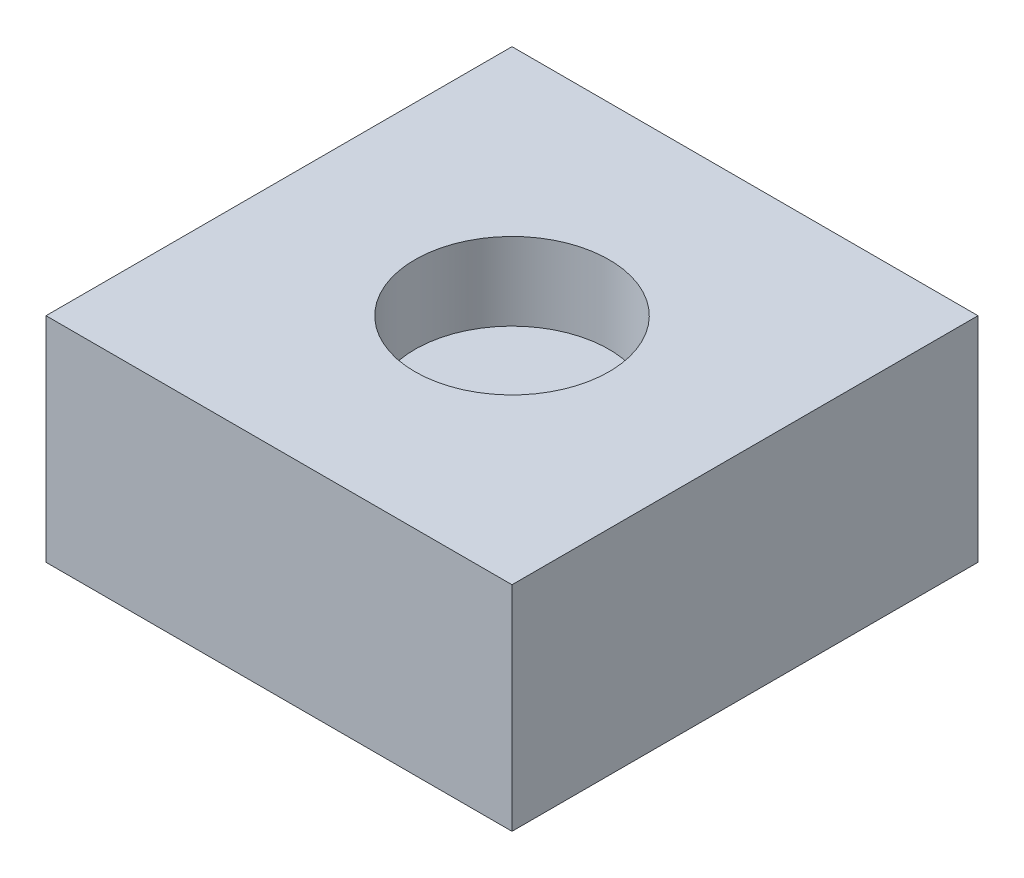
ISO-10303-21;
HEADER;
FILE_DESCRIPTION(('STEP AP214'),'2;1');
FILE_NAME('part.step','',(''),(''),'','','');
FILE_SCHEMA(('AUTOMOTIVE_DESIGN { 1 0 10303 214 1 1 1 1 }'));
ENDSEC;
DATA;
#1=APPLICATION_CONTEXT('core data for automotive mechanical design processes');
#2=APPLICATION_PROTOCOL_DEFINITION('international standard','automotive_design',2000,#1);
#3=PRODUCT_CONTEXT('',#1,'mechanical');
#4=PRODUCT('Part','Part','',(#3));
#5=PRODUCT_RELATED_PRODUCT_CATEGORY('part','',(#4));
#6=PRODUCT_DEFINITION_FORMATION('','',#4);
#7=PRODUCT_DEFINITION_CONTEXT('part definition',#1,'design');
#8=PRODUCT_DEFINITION('design','',#6,#7);
#9=PRODUCT_DEFINITION_SHAPE('','',#8);
#10=(LENGTH_UNIT() NAMED_UNIT(*) SI_UNIT(.MILLI.,.METRE.));
#11=(NAMED_UNIT(*) PLANE_ANGLE_UNIT() SI_UNIT($,.RADIAN.));
#12=(NAMED_UNIT(*) SI_UNIT($,.STERADIAN.) SOLID_ANGLE_UNIT());
#13=UNCERTAINTY_MEASURE_WITH_UNIT(LENGTH_MEASURE(1.E-05),#10,'distance_accuracy_value','');
#14=(GEOMETRIC_REPRESENTATION_CONTEXT(3) GLOBAL_UNCERTAINTY_ASSIGNED_CONTEXT((#13)) GLOBAL_UNIT_ASSIGNED_CONTEXT((#10,
#11,#12)) REPRESENTATION_CONTEXT('',''));
#15=CARTESIAN_POINT('',(0.,0.,0.));
#16=DIRECTION('',(0.,0.,1.));
#17=DIRECTION('',(1.,0.,0.));
#18=AXIS2_PLACEMENT_3D('',#15,#16,#17);
#19=CARTESIAN_POINT('',(6.,5.5,6.));
#20=DIRECTION('',(-1.,0.,0.));
#21=DIRECTION('',(0.,0.,1.));
#22=AXIS2_PLACEMENT_3D('',#19,#20,#21);
#23=PLANE('',#22);
#24=DIRECTION('',(0.,0.,-1.));
#25=VECTOR('',#24,1.);
#26=CARTESIAN_POINT('',(6.,0.,6.));
#27=LINE('',#26,#25);
#28=CARTESIAN_POINT('',(6.,0.,6.));
#29=VERTEX_POINT('',#28);
#30=CARTESIAN_POINT('',(6.,0.,-6.));
#31=VERTEX_POINT('',#30);
#32=EDGE_CURVE('E100',#29,#31,#27,.T.);
#33=ORIENTED_EDGE('',*,*,#32,.T.);
#34=DIRECTION('',(0.,-1.,0.));
#35=VECTOR('',#34,1.);
#36=CARTESIAN_POINT('',(6.,5.5,-6.));
#37=LINE('',#36,#35);
#38=CARTESIAN_POINT('',(6.,5.5,-6.));
#39=VERTEX_POINT('',#38);
#40=EDGE_CURVE('E42',#39,#31,#37,.T.);
#41=ORIENTED_EDGE('',*,*,#40,.F.);
#42=DIRECTION('',(0.,0.,-1.));
#43=VECTOR('',#42,1.);
#44=CARTESIAN_POINT('',(6.,5.5,6.));
#45=LINE('',#44,#43);
#46=CARTESIAN_POINT('',(6.,5.5,6.));
#47=VERTEX_POINT('',#46);
#48=EDGE_CURVE('E86',#47,#39,#45,.T.);
#49=ORIENTED_EDGE('',*,*,#48,.F.);
#50=DIRECTION('',(0.,-1.,0.));
#51=VECTOR('',#50,1.);
#52=CARTESIAN_POINT('',(6.,5.5,6.));
#53=LINE('',#52,#51);
#54=EDGE_CURVE('E96',#47,#29,#53,.T.);
#55=ORIENTED_EDGE('',*,*,#54,.T.);
#56=EDGE_LOOP('',(#33,#41,#49,#55));
#57=FACE_BOUND('',#56,.T.);
#58=ADVANCED_FACE('F33',(#57),#23,.F.);
#59=CARTESIAN_POINT('',(-6.,5.5,-6.));
#60=DIRECTION('',(0.,0.,1.));
#61=DIRECTION('',(1.,0.,0.));
#62=AXIS2_PLACEMENT_3D('',#59,#60,#61);
#63=PLANE('',#62);
#64=DIRECTION('',(-1.,0.,0.));
#65=VECTOR('',#64,1.);
#66=CARTESIAN_POINT('',(-6.,0.,-6.));
#67=LINE('',#66,#65);
#68=CARTESIAN_POINT('',(-6.,0.,-6.));
#69=VERTEX_POINT('',#68);
#70=EDGE_CURVE('E91',#31,#69,#67,.T.);
#71=ORIENTED_EDGE('',*,*,#70,.T.);
#72=DIRECTION('',(0.,-1.,0.));
#73=VECTOR('',#72,1.);
#74=CARTESIAN_POINT('',(-6.,5.5,-6.));
#75=LINE('',#74,#73);
#76=CARTESIAN_POINT('',(-6.,5.5,-6.));
#77=VERTEX_POINT('',#76);
#78=EDGE_CURVE('E89',#77,#69,#75,.T.);
#79=ORIENTED_EDGE('',*,*,#78,.F.);
#80=DIRECTION('',(-1.,0.,0.));
#81=VECTOR('',#80,1.);
#82=CARTESIAN_POINT('',(-6.,5.5,-6.));
#83=LINE('',#82,#81);
#84=EDGE_CURVE('E81',#39,#77,#83,.T.);
#85=ORIENTED_EDGE('',*,*,#84,.F.);
#86=ORIENTED_EDGE('',*,*,#40,.T.);
#87=EDGE_LOOP('',(#71,#79,#85,#86));
#88=FACE_BOUND('',#87,.T.);
#89=ADVANCED_FACE('F90',(#88),#63,.F.);
#90=CARTESIAN_POINT('',(-6.,5.5,6.));
#91=DIRECTION('',(1.,0.,0.));
#92=DIRECTION('',(0.,0.,-1.));
#93=AXIS2_PLACEMENT_3D('',#90,#91,#92);
#94=PLANE('',#93);
#95=DIRECTION('',(0.,0.,1.));
#96=VECTOR('',#95,1.);
#97=CARTESIAN_POINT('',(-6.,0.,6.));
#98=LINE('',#97,#96);
#99=CARTESIAN_POINT('',(-6.,0.,6.));
#100=VERTEX_POINT('',#99);
#101=EDGE_CURVE('E67',#69,#100,#98,.T.);
#102=ORIENTED_EDGE('',*,*,#101,.T.);
#103=DIRECTION('',(0.,-1.,0.));
#104=VECTOR('',#103,1.);
#105=CARTESIAN_POINT('',(-6.,5.5,6.));
#106=LINE('',#105,#104);
#107=CARTESIAN_POINT('',(-6.,5.5,6.));
#108=VERTEX_POINT('',#107);
#109=EDGE_CURVE('E92',#108,#100,#106,.T.);
#110=ORIENTED_EDGE('',*,*,#109,.F.);
#111=DIRECTION('',(0.,0.,1.));
#112=VECTOR('',#111,1.);
#113=CARTESIAN_POINT('',(-6.,5.5,6.));
#114=LINE('',#113,#112);
#115=EDGE_CURVE('E84',#77,#108,#114,.T.);
#116=ORIENTED_EDGE('',*,*,#115,.F.);
#117=ORIENTED_EDGE('',*,*,#78,.T.);
#118=EDGE_LOOP('',(#102,#110,#116,#117));
#119=FACE_BOUND('',#118,.T.);
#120=ADVANCED_FACE('F94',(#119),#94,.F.);
#121=CARTESIAN_POINT('',(-6.,5.5,6.));
#122=DIRECTION('',(0.,0.,-1.));
#123=DIRECTION('',(-1.,0.,0.));
#124=AXIS2_PLACEMENT_3D('',#121,#122,#123);
#125=PLANE('',#124);
#126=DIRECTION('',(1.,0.,0.));
#127=VECTOR('',#126,1.);
#128=CARTESIAN_POINT('',(-6.,0.,6.));
#129=LINE('',#128,#127);
#130=EDGE_CURVE('E73',#100,#29,#129,.T.);
#131=ORIENTED_EDGE('',*,*,#130,.T.);
#132=ORIENTED_EDGE('',*,*,#54,.F.);
#133=DIRECTION('',(1.,0.,0.));
#134=VECTOR('',#133,1.);
#135=CARTESIAN_POINT('',(-6.,5.5,6.));
#136=LINE('',#135,#134);
#137=EDGE_CURVE('E50',#108,#47,#136,.T.);
#138=ORIENTED_EDGE('',*,*,#137,.F.);
#139=ORIENTED_EDGE('',*,*,#109,.T.);
#140=EDGE_LOOP('',(#131,#132,#138,#139));
#141=FACE_BOUND('',#140,.T.);
#142=ADVANCED_FACE('F123',(#141),#125,.F.);
#143=CARTESIAN_POINT('',(0.,5.5,0.));
#144=DIRECTION('',(0.,-1.,0.));
#145=DIRECTION('',(0.,0.,-1.));
#146=AXIS2_PLACEMENT_3D('',#143,#144,#145);
#147=PLANE('',#146);
#148=CARTESIAN_POINT('',(0.,5.5,0.));
#149=DIRECTION('',(0.,1.,0.));
#150=DIRECTION('',(0.,0.,1.));
#151=AXIS2_PLACEMENT_3D('',#148,#149,#150);
#152=CIRCLE('',#151,2.5);
#153=CARTESIAN_POINT('',(0.,5.5,2.5));
#154=VERTEX_POINT('',#153);
#155=EDGE_CURVE('E189',#154,#154,#152,.T.);
#156=ORIENTED_EDGE('',*,*,#155,.F.);
#157=EDGE_LOOP('',(#156));
#158=FACE_BOUND('',#157,.T.);
#159=ORIENTED_EDGE('',*,*,#48,.T.);
#160=ORIENTED_EDGE('',*,*,#84,.T.);
#161=ORIENTED_EDGE('',*,*,#115,.T.);
#162=ORIENTED_EDGE('',*,*,#137,.T.);
#163=EDGE_LOOP('',(#159,#160,#161,#162));
#164=FACE_BOUND('',#163,.T.);
#165=ADVANCED_FACE('F82',(#158,#164),#147,.F.);
#166=CARTESIAN_POINT('',(0.,0.,0.));
#167=DIRECTION('',(0.,-1.,0.));
#168=DIRECTION('',(0.,0.,-1.));
#169=AXIS2_PLACEMENT_3D('',#166,#167,#168);
#170=PLANE('',#169);
#171=CARTESIAN_POINT('',(0.,0.,0.));
#172=DIRECTION('',(0.,-1.,0.));
#173=DIRECTION('',(0.,0.,-1.));
#174=AXIS2_PLACEMENT_3D('',#171,#172,#173);
#175=CIRCLE('',#174,1.);
#176=CARTESIAN_POINT('',(0.,0.,-1.));
#177=VERTEX_POINT('',#176);
#178=EDGE_CURVE('E188',#177,#177,#175,.T.);
#179=ORIENTED_EDGE('',*,*,#178,.F.);
#180=EDGE_LOOP('',(#179));
#181=FACE_BOUND('',#180,.T.);
#182=ORIENTED_EDGE('',*,*,#32,.F.);
#183=ORIENTED_EDGE('',*,*,#130,.F.);
#184=ORIENTED_EDGE('',*,*,#101,.F.);
#185=ORIENTED_EDGE('',*,*,#70,.F.);
#186=EDGE_LOOP('',(#182,#183,#184,#185));
#187=FACE_BOUND('',#186,.T.);
#188=ADVANCED_FACE('F111',(#181,#187),#170,.T.);
#189=CARTESIAN_POINT('',(0.,3.5,0.));
#190=DIRECTION('',(0.,1.,0.));
#191=DIRECTION('',(0.,0.,1.));
#192=AXIS2_PLACEMENT_3D('',#189,#190,#191);
#193=CYLINDRICAL_SURFACE('',#192,2.5);
#194=CARTESIAN_POINT('',(0.,3.5,0.));
#195=DIRECTION('',(0.,1.,0.));
#196=DIRECTION('',(0.,0.,1.));
#197=AXIS2_PLACEMENT_3D('',#194,#195,#196);
#198=CIRCLE('',#197,2.5);
#199=CARTESIAN_POINT('',(0.,3.5,2.5));
#200=VERTEX_POINT('',#199);
#201=EDGE_CURVE('E103',#200,#200,#198,.T.);
#202=ORIENTED_EDGE('',*,*,#201,.F.);
#203=EDGE_LOOP('',(#202));
#204=FACE_BOUND('',#203,.T.);
#205=ORIENTED_EDGE('',*,*,#155,.T.);
#206=EDGE_LOOP('',(#205));
#207=FACE_BOUND('',#206,.T.);
#208=ADVANCED_FACE('F113',(#204,#207),#193,.F.);
#209=CARTESIAN_POINT('',(0.,3.5,0.));
#210=DIRECTION('',(0.,1.,0.));
#211=DIRECTION('',(0.,0.,1.));
#212=AXIS2_PLACEMENT_3D('',#209,#210,#211);
#213=PLANE('',#212);
#214=ORIENTED_EDGE('',*,*,#201,.T.);
#215=EDGE_LOOP('',(#214));
#216=FACE_BOUND('',#215,.T.);
#217=ADVANCED_FACE('F120',(#216),#213,.T.);
#218=CARTESIAN_POINT('',(0.,2.,0.));
#219=DIRECTION('',(0.,-1.,0.));
#220=DIRECTION('',(0.,0.,-1.));
#221=AXIS2_PLACEMENT_3D('',#218,#219,#220);
#222=CYLINDRICAL_SURFACE('',#221,1.);
#223=CARTESIAN_POINT('',(0.,1.,0.));
#224=DIRECTION('',(0.,-1.,0.));
#225=DIRECTION('',(0.,0.,-1.));
#226=AXIS2_PLACEMENT_3D('',#223,#224,#225);
#227=CIRCLE('',#226,1.);
#228=CARTESIAN_POINT('',(0.,1.,-1.));
#229=VERTEX_POINT('',#228);
#230=EDGE_CURVE('E11',#229,#229,#227,.F.);
#231=ORIENTED_EDGE('',*,*,#230,.T.);
#232=EDGE_LOOP('',(#231));
#233=FACE_BOUND('',#232,.T.);
#234=ORIENTED_EDGE('',*,*,#178,.T.);
#235=EDGE_LOOP('',(#234));
#236=FACE_BOUND('',#235,.T.);
#237=ADVANCED_FACE('F159',(#233,#236),#222,.F.);
#238=CARTESIAN_POINT('',(0.,1.,0.));
#239=DIRECTION('',(0.,-1.,0.));
#240=DIRECTION('',(0.,0.,-1.));
#241=AXIS2_PLACEMENT_3D('',#238,#239,#240);
#242=SPHERICAL_SURFACE('',#241,1.);
#243=ORIENTED_EDGE('',*,*,#230,.F.);
#244=EDGE_LOOP('',(#243));
#245=FACE_BOUND('',#244,.T.);
#246=ADVANCED_FACE('F35',(#245),#242,.F.);
#247=CLOSED_SHELL('',(#58,#89,#120,#142,#165,#188,#208,#217,#237,#246));
#248=MANIFOLD_SOLID_BREP('B2',#247);
#249=ADVANCED_BREP_SHAPE_REPRESENTATION('',(#18,#248),#14);
#250=SHAPE_DEFINITION_REPRESENTATION(#9,#249);
ENDSEC;
END-ISO-10303-21;
